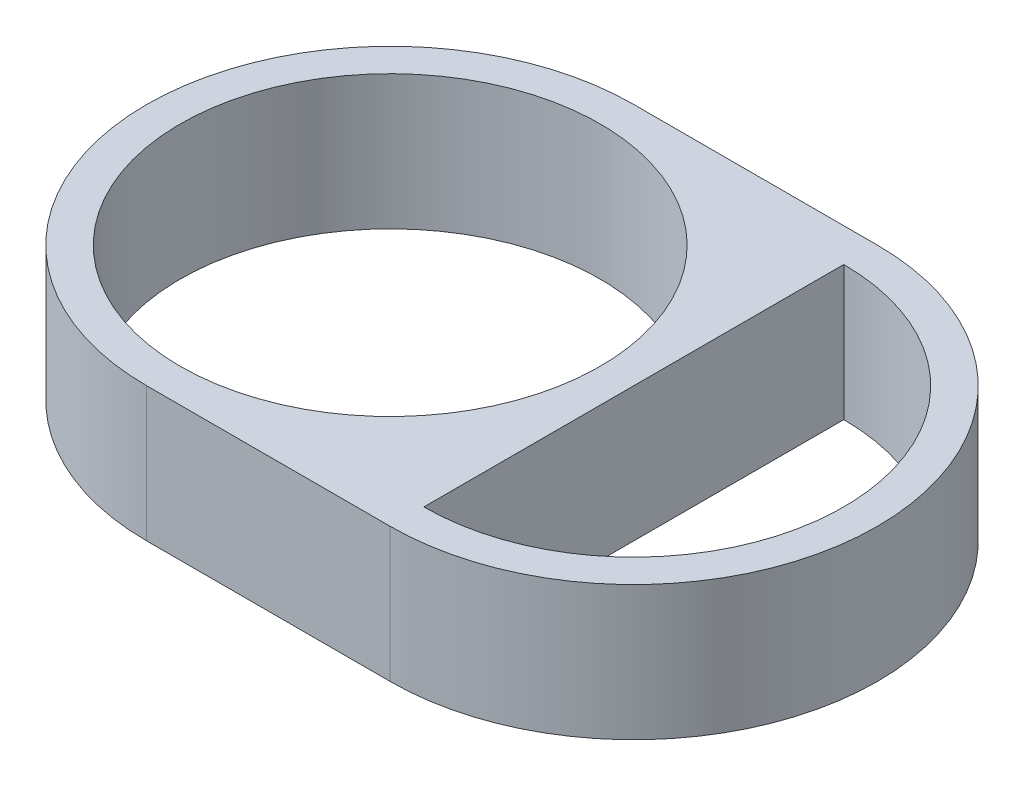
ISO-10303-21;
HEADER;
FILE_DESCRIPTION(('STEP AP214'),'2;1');
FILE_NAME('part.step','',(''),(''),'','','');
FILE_SCHEMA(('AUTOMOTIVE_DESIGN { 1 0 10303 214 1 1 1 1 }'));
ENDSEC;
DATA;
#1=APPLICATION_CONTEXT('core data for automotive mechanical design processes');
#2=APPLICATION_PROTOCOL_DEFINITION('international standard','automotive_design',2000,#1);
#3=PRODUCT_CONTEXT('',#1,'mechanical');
#4=PRODUCT('Part','Part','',(#3));
#5=PRODUCT_RELATED_PRODUCT_CATEGORY('part','',(#4));
#6=PRODUCT_DEFINITION_FORMATION('','',#4);
#7=PRODUCT_DEFINITION_CONTEXT('part definition',#1,'design');
#8=PRODUCT_DEFINITION('design','',#6,#7);
#9=PRODUCT_DEFINITION_SHAPE('','',#8);
#10=(LENGTH_UNIT() NAMED_UNIT(*) SI_UNIT(.MILLI.,.METRE.));
#11=(NAMED_UNIT(*) PLANE_ANGLE_UNIT() SI_UNIT($,.RADIAN.));
#12=(NAMED_UNIT(*) SI_UNIT($,.STERADIAN.) SOLID_ANGLE_UNIT());
#13=UNCERTAINTY_MEASURE_WITH_UNIT(LENGTH_MEASURE(1.E-05),#10,'distance_accuracy_value','');
#14=(GEOMETRIC_REPRESENTATION_CONTEXT(3) GLOBAL_UNCERTAINTY_ASSIGNED_CONTEXT((#13)) GLOBAL_UNIT_ASSIGNED_CONTEXT((#10,
#11,#12)) REPRESENTATION_CONTEXT('',''));
#15=CARTESIAN_POINT('',(0.,0.,0.));
#16=DIRECTION('',(0.,0.,1.));
#17=DIRECTION('',(1.,0.,0.));
#18=AXIS2_PLACEMENT_3D('',#15,#16,#17);
#19=CARTESIAN_POINT('',(14.5,8.,0.));
#20=DIRECTION('',(-1.,0.,0.));
#21=DIRECTION('',(0.,0.,1.));
#22=AXIS2_PLACEMENT_3D('',#19,#20,#21);
#23=PLANE('',#22);
#24=DIRECTION('',(0.,-1.,0.));
#25=VECTOR('',#24,1.);
#26=CARTESIAN_POINT('',(14.5,8.,-12.5));
#27=LINE('',#26,#25);
#28=CARTESIAN_POINT('',(14.5,8.,-12.5));
#29=VERTEX_POINT('',#28);
#30=CARTESIAN_POINT('',(14.5,0.,-12.5));
#31=VERTEX_POINT('',#30);
#32=EDGE_CURVE('E52',#29,#31,#27,.T.);
#33=ORIENTED_EDGE('',*,*,#32,.F.);
#34=DIRECTION('',(0.,0.,-1.));
#35=VECTOR('',#34,1.);
#36=CARTESIAN_POINT('',(14.5,8.,0.));
#37=LINE('',#36,#35);
#38=CARTESIAN_POINT('',(14.5,8.,12.5));
#39=VERTEX_POINT('',#38);
#40=EDGE_CURVE('E56',#39,#29,#37,.T.);
#41=ORIENTED_EDGE('',*,*,#40,.F.);
#42=DIRECTION('',(0.,-1.,0.));
#43=VECTOR('',#42,1.);
#44=CARTESIAN_POINT('',(14.5,8.,12.5));
#45=LINE('',#44,#43);
#46=CARTESIAN_POINT('',(14.5,0.,12.5));
#47=VERTEX_POINT('',#46);
#48=EDGE_CURVE('E96',#39,#47,#45,.T.);
#49=ORIENTED_EDGE('',*,*,#48,.T.);
#50=DIRECTION('',(0.,0.,-1.));
#51=VECTOR('',#50,1.);
#52=CARTESIAN_POINT('',(14.5,0.,0.));
#53=LINE('',#52,#51);
#54=EDGE_CURVE('E88',#47,#31,#53,.T.);
#55=ORIENTED_EDGE('',*,*,#54,.T.);
#56=EDGE_LOOP('',(#33,#41,#49,#55));
#57=FACE_BOUND('',#56,.T.);
#58=ADVANCED_FACE('F37',(#57),#23,.F.);
#59=CARTESIAN_POINT('',(0.,8.,-14.5));
#60=DIRECTION('',(0.,0.,1.));
#61=DIRECTION('',(1.,0.,0.));
#62=AXIS2_PLACEMENT_3D('',#59,#60,#61);
#63=PLANE('',#62);
#64=DIRECTION('',(-1.,0.,0.));
#65=VECTOR('',#64,1.);
#66=CARTESIAN_POINT('',(0.,0.,-14.5));
#67=LINE('',#66,#65);
#68=CARTESIAN_POINT('',(14.5,0.,-14.5));
#69=VERTEX_POINT('',#68);
#70=CARTESIAN_POINT('',(0.,0.,-14.5));
#71=VERTEX_POINT('',#70);
#72=EDGE_CURVE('E125',#69,#71,#67,.T.);
#73=ORIENTED_EDGE('',*,*,#72,.T.);
#74=DIRECTION('',(0.,-1.,0.));
#75=VECTOR('',#74,1.);
#76=CARTESIAN_POINT('',(0.,8.,-14.5));
#77=LINE('',#76,#75);
#78=CARTESIAN_POINT('',(0.,8.,-14.5));
#79=VERTEX_POINT('',#78);
#80=EDGE_CURVE('E11',#79,#71,#77,.T.);
#81=ORIENTED_EDGE('',*,*,#80,.F.);
#82=DIRECTION('',(-1.,0.,0.));
#83=VECTOR('',#82,1.);
#84=CARTESIAN_POINT('',(0.,8.,-14.5));
#85=LINE('',#84,#83);
#86=CARTESIAN_POINT('',(14.5,8.,-14.5));
#87=VERTEX_POINT('',#86);
#88=EDGE_CURVE('E114',#87,#79,#85,.T.);
#89=ORIENTED_EDGE('',*,*,#88,.F.);
#90=DIRECTION('',(0.,-1.,0.));
#91=VECTOR('',#90,1.);
#92=CARTESIAN_POINT('',(14.5,8.,-14.5));
#93=LINE('',#92,#91);
#94=EDGE_CURVE('E122',#87,#69,#93,.T.);
#95=ORIENTED_EDGE('',*,*,#94,.T.);
#96=EDGE_LOOP('',(#73,#81,#89,#95));
#97=FACE_BOUND('',#96,.T.);
#98=ADVANCED_FACE('F165',(#97),#63,.F.);
#99=CARTESIAN_POINT('',(0.,8.,0.));
#100=DIRECTION('',(0.,-1.,0.));
#101=DIRECTION('',(0.,0.,-1.));
#102=AXIS2_PLACEMENT_3D('',#99,#100,#101);
#103=CYLINDRICAL_SURFACE('',#102,14.5);
#104=CARTESIAN_POINT('',(0.,0.,0.));
#105=DIRECTION('',(0.,1.,0.));
#106=DIRECTION('',(0.,0.,1.));
#107=AXIS2_PLACEMENT_3D('',#104,#105,#106);
#108=CIRCLE('',#107,14.5);
#109=CARTESIAN_POINT('',(0.,0.,14.5));
#110=VERTEX_POINT('',#109);
#111=EDGE_CURVE('E128',#71,#110,#108,.T.);
#112=ORIENTED_EDGE('',*,*,#111,.T.);
#113=DIRECTION('',(0.,-1.,0.));
#114=VECTOR('',#113,1.);
#115=CARTESIAN_POINT('',(0.,8.,14.5));
#116=LINE('',#115,#114);
#117=CARTESIAN_POINT('',(0.,8.,14.5));
#118=VERTEX_POINT('',#117);
#119=EDGE_CURVE('E45',#118,#110,#116,.T.);
#120=ORIENTED_EDGE('',*,*,#119,.F.);
#121=CARTESIAN_POINT('',(0.,8.,0.));
#122=DIRECTION('',(0.,1.,0.));
#123=DIRECTION('',(0.,0.,1.));
#124=AXIS2_PLACEMENT_3D('',#121,#122,#123);
#125=CIRCLE('',#124,14.5);
#126=EDGE_CURVE('E117',#79,#118,#125,.T.);
#127=ORIENTED_EDGE('',*,*,#126,.F.);
#128=ORIENTED_EDGE('',*,*,#80,.T.);
#129=EDGE_LOOP('',(#112,#120,#127,#128));
#130=FACE_BOUND('',#129,.T.);
#131=ADVANCED_FACE('F170',(#130),#103,.T.);
#132=CARTESIAN_POINT('',(0.,8.,14.5));
#133=DIRECTION('',(0.,0.,-1.));
#134=DIRECTION('',(-1.,0.,0.));
#135=AXIS2_PLACEMENT_3D('',#132,#133,#134);
#136=PLANE('',#135);
#137=DIRECTION('',(1.,0.,0.));
#138=VECTOR('',#137,1.);
#139=CARTESIAN_POINT('',(0.,0.,14.5));
#140=LINE('',#139,#138);
#141=CARTESIAN_POINT('',(14.5,0.,14.5));
#142=VERTEX_POINT('',#141);
#143=EDGE_CURVE('E93',#110,#142,#140,.T.);
#144=ORIENTED_EDGE('',*,*,#143,.T.);
#145=DIRECTION('',(0.,-1.,0.));
#146=VECTOR('',#145,1.);
#147=CARTESIAN_POINT('',(14.5,8.,14.5));
#148=LINE('',#147,#146);
#149=CARTESIAN_POINT('',(14.5,8.,14.5));
#150=VERTEX_POINT('',#149);
#151=EDGE_CURVE('E133',#150,#142,#148,.T.);
#152=ORIENTED_EDGE('',*,*,#151,.F.);
#153=DIRECTION('',(1.,0.,0.));
#154=VECTOR('',#153,1.);
#155=CARTESIAN_POINT('',(0.,8.,14.5));
#156=LINE('',#155,#154);
#157=EDGE_CURVE('E119',#118,#150,#156,.T.);
#158=ORIENTED_EDGE('',*,*,#157,.F.);
#159=ORIENTED_EDGE('',*,*,#119,.T.);
#160=EDGE_LOOP('',(#144,#152,#158,#159));
#161=FACE_BOUND('',#160,.T.);
#162=ADVANCED_FACE('F140',(#161),#136,.F.);
#163=CARTESIAN_POINT('',(0.,8.,0.));
#164=DIRECTION('',(0.,-1.,0.));
#165=DIRECTION('',(0.,0.,-1.));
#166=AXIS2_PLACEMENT_3D('',#163,#164,#165);
#167=CYLINDRICAL_SURFACE('',#166,12.5);
#168=CARTESIAN_POINT('',(0.,8.,0.));
#169=DIRECTION('',(0.,1.,0.));
#170=DIRECTION('',(0.,0.,1.));
#171=AXIS2_PLACEMENT_3D('',#168,#169,#170);
#172=CIRCLE('',#171,12.5);
#173=CARTESIAN_POINT('',(0.,8.,12.5));
#174=VERTEX_POINT('',#173);
#175=EDGE_CURVE('E92',#174,#174,#172,.T.);
#176=ORIENTED_EDGE('',*,*,#175,.T.);
#177=EDGE_LOOP('',(#176));
#178=FACE_BOUND('',#177,.T.);
#179=CARTESIAN_POINT('',(0.,0.,0.));
#180=DIRECTION('',(0.,1.,0.));
#181=DIRECTION('',(0.,0.,1.));
#182=AXIS2_PLACEMENT_3D('',#179,#180,#181);
#183=CIRCLE('',#182,12.5);
#184=CARTESIAN_POINT('',(0.,0.,12.5));
#185=VERTEX_POINT('',#184);
#186=EDGE_CURVE('E111',#185,#185,#183,.T.);
#187=ORIENTED_EDGE('',*,*,#186,.F.);
#188=EDGE_LOOP('',(#187));
#189=FACE_BOUND('',#188,.T.);
#190=ADVANCED_FACE('F39',(#178,#189),#167,.F.);
#191=CARTESIAN_POINT('',(0.,8.,0.));
#192=DIRECTION('',(0.,1.,0.));
#193=DIRECTION('',(0.,0.,1.));
#194=AXIS2_PLACEMENT_3D('',#191,#192,#193);
#195=PLANE('',#194);
#196=CARTESIAN_POINT('',(14.5,8.,0.));
#197=DIRECTION('',(0.,1.,0.));
#198=DIRECTION('',(0.,0.,1.));
#199=AXIS2_PLACEMENT_3D('',#196,#197,#198);
#200=CIRCLE('',#199,14.5);
#201=EDGE_CURVE('E99',#87,#150,#200,.F.);
#202=ORIENTED_EDGE('',*,*,#201,.F.);
#203=ORIENTED_EDGE('',*,*,#88,.T.);
#204=ORIENTED_EDGE('',*,*,#126,.T.);
#205=ORIENTED_EDGE('',*,*,#157,.T.);
#206=EDGE_LOOP('',(#202,#203,#204,#205));
#207=FACE_BOUND('',#206,.T.);
#208=ORIENTED_EDGE('',*,*,#175,.F.);
#209=EDGE_LOOP('',(#208));
#210=FACE_BOUND('',#209,.T.);
#211=ORIENTED_EDGE('',*,*,#40,.T.);
#212=CARTESIAN_POINT('',(14.5,8.,0.));
#213=DIRECTION('',(0.,1.,0.));
#214=DIRECTION('',(0.,0.,1.));
#215=AXIS2_PLACEMENT_3D('',#212,#213,#214);
#216=CIRCLE('',#215,12.5);
#217=EDGE_CURVE('E105',#29,#39,#216,.F.);
#218=ORIENTED_EDGE('',*,*,#217,.T.);
#219=EDGE_LOOP('',(#211,#218));
#220=FACE_BOUND('',#219,.T.);
#221=ADVANCED_FACE('F153',(#207,#210,#220),#195,.T.);
#222=CARTESIAN_POINT('',(0.,0.,0.));
#223=DIRECTION('',(0.,1.,0.));
#224=DIRECTION('',(0.,0.,1.));
#225=AXIS2_PLACEMENT_3D('',#222,#223,#224);
#226=PLANE('',#225);
#227=ORIENTED_EDGE('',*,*,#72,.F.);
#228=CARTESIAN_POINT('',(14.5,0.,0.));
#229=DIRECTION('',(0.,1.,0.));
#230=DIRECTION('',(0.,0.,1.));
#231=AXIS2_PLACEMENT_3D('',#228,#229,#230);
#232=CIRCLE('',#231,14.5);
#233=EDGE_CURVE('E102',#69,#142,#232,.F.);
#234=ORIENTED_EDGE('',*,*,#233,.T.);
#235=ORIENTED_EDGE('',*,*,#143,.F.);
#236=ORIENTED_EDGE('',*,*,#111,.F.);
#237=EDGE_LOOP('',(#227,#234,#235,#236));
#238=FACE_BOUND('',#237,.T.);
#239=ORIENTED_EDGE('',*,*,#186,.T.);
#240=EDGE_LOOP('',(#239));
#241=FACE_BOUND('',#240,.T.);
#242=CARTESIAN_POINT('',(14.5,0.,0.));
#243=DIRECTION('',(0.,1.,0.));
#244=DIRECTION('',(0.,0.,1.));
#245=AXIS2_PLACEMENT_3D('',#242,#243,#244);
#246=CIRCLE('',#245,12.5);
#247=EDGE_CURVE('E91',#31,#47,#246,.F.);
#248=ORIENTED_EDGE('',*,*,#247,.F.);
#249=ORIENTED_EDGE('',*,*,#54,.F.);
#250=EDGE_LOOP('',(#248,#249));
#251=FACE_BOUND('',#250,.T.);
#252=ADVANCED_FACE('F89',(#238,#241,#251),#226,.F.);
#253=CARTESIAN_POINT('',(14.5,8.,0.));
#254=DIRECTION('',(0.,-1.,0.));
#255=DIRECTION('',(0.,0.,-1.));
#256=AXIS2_PLACEMENT_3D('',#253,#254,#255);
#257=CYLINDRICAL_SURFACE('',#256,12.5);
#258=ORIENTED_EDGE('',*,*,#247,.T.);
#259=ORIENTED_EDGE('',*,*,#48,.F.);
#260=ORIENTED_EDGE('',*,*,#217,.F.);
#261=ORIENTED_EDGE('',*,*,#32,.T.);
#262=EDGE_LOOP('',(#258,#259,#260,#261));
#263=FACE_BOUND('',#262,.T.);
#264=ADVANCED_FACE('F101',(#263),#257,.F.);
#265=CARTESIAN_POINT('',(14.5,8.,0.));
#266=DIRECTION('',(0.,-1.,0.));
#267=DIRECTION('',(0.,0.,-1.));
#268=AXIS2_PLACEMENT_3D('',#265,#266,#267);
#269=CYLINDRICAL_SURFACE('',#268,14.5);
#270=ORIENTED_EDGE('',*,*,#233,.F.);
#271=ORIENTED_EDGE('',*,*,#94,.F.);
#272=ORIENTED_EDGE('',*,*,#201,.T.);
#273=ORIENTED_EDGE('',*,*,#151,.T.);
#274=EDGE_LOOP('',(#270,#271,#272,#273));
#275=FACE_BOUND('',#274,.T.);
#276=ADVANCED_FACE('F148',(#275),#269,.T.);
#277=CLOSED_SHELL('',(#58,#98,#131,#162,#190,#221,#252,#264,#276));
#278=MANIFOLD_SOLID_BREP('B2',#277);
#279=ADVANCED_BREP_SHAPE_REPRESENTATION('',(#18,#278),#14);
#280=SHAPE_DEFINITION_REPRESENTATION(#9,#279);
ENDSEC;
END-ISO-10303-21;
